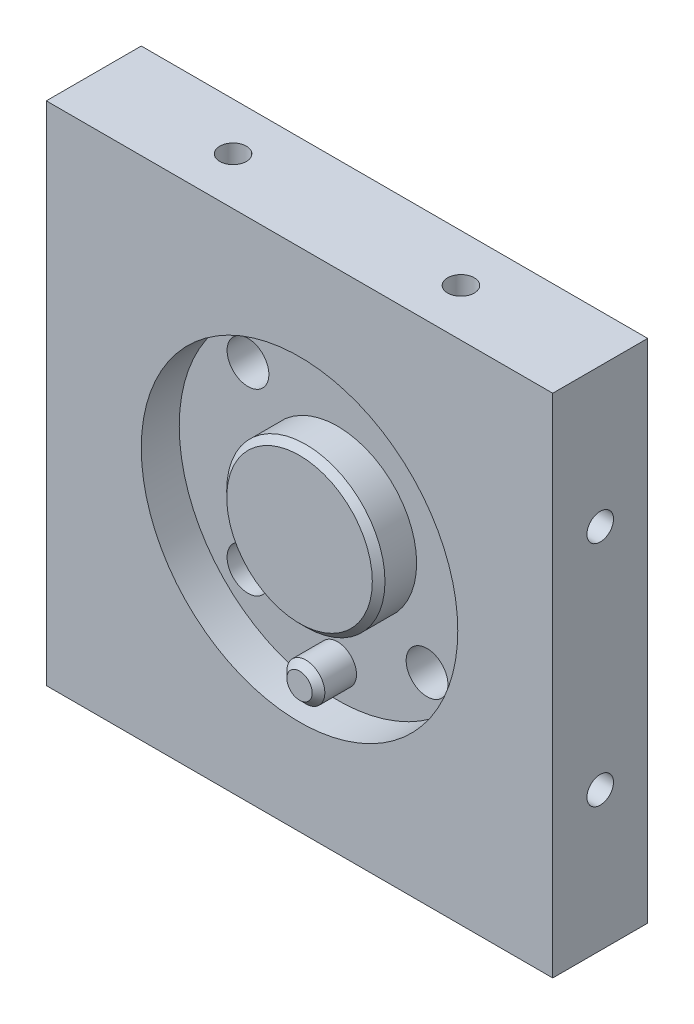
ISO-10303-21;
HEADER;
FILE_DESCRIPTION(('STEP AP214'),'2;1');
FILE_NAME('part.step','',(''),(''),'','','');
FILE_SCHEMA(('AUTOMOTIVE_DESIGN { 1 0 10303 214 1 1 1 1 }'));
ENDSEC;
DATA;
#1=APPLICATION_CONTEXT('core data for automotive mechanical design processes');
#2=APPLICATION_PROTOCOL_DEFINITION('international standard','automotive_design',2000,#1);
#3=PRODUCT_CONTEXT('',#1,'mechanical');
#4=PRODUCT('Part','Part','',(#3));
#5=PRODUCT_RELATED_PRODUCT_CATEGORY('part','',(#4));
#6=PRODUCT_DEFINITION_FORMATION('','',#4);
#7=PRODUCT_DEFINITION_CONTEXT('part definition',#1,'design');
#8=PRODUCT_DEFINITION('design','',#6,#7);
#9=PRODUCT_DEFINITION_SHAPE('','',#8);
#10=(LENGTH_UNIT() NAMED_UNIT(*) SI_UNIT(.MILLI.,.METRE.));
#11=(NAMED_UNIT(*) PLANE_ANGLE_UNIT() SI_UNIT($,.RADIAN.));
#12=(NAMED_UNIT(*) SI_UNIT($,.STERADIAN.) SOLID_ANGLE_UNIT());
#13=UNCERTAINTY_MEASURE_WITH_UNIT(LENGTH_MEASURE(1.E-05),#10,'distance_accuracy_value','');
#14=(GEOMETRIC_REPRESENTATION_CONTEXT(3) GLOBAL_UNCERTAINTY_ASSIGNED_CONTEXT((#13)) GLOBAL_UNIT_ASSIGNED_CONTEXT((#10,
#11,#12)) REPRESENTATION_CONTEXT('',''));
#15=CARTESIAN_POINT('',(0.,0.,0.));
#16=DIRECTION('',(0.,0.,1.));
#17=DIRECTION('',(1.,0.,0.));
#18=AXIS2_PLACEMENT_3D('',#15,#16,#17);
#19=CARTESIAN_POINT('',(-40.,-40.,0.));
#20=DIRECTION('',(0.,0.,1.));
#21=DIRECTION('',(1.,0.,0.));
#22=AXIS2_PLACEMENT_3D('',#19,#20,#21);
#23=PLANE('',#22);
#24=CARTESIAN_POINT('',(14.1421356237311,-14.1421356237308,0.));
#25=DIRECTION('',(0.,0.,-1.));
#26=DIRECTION('',(0.,1.,0.));
#27=AXIS2_PLACEMENT_3D('',#24,#25,#26);
#28=CIRCLE('',#27,5.5);
#29=CARTESIAN_POINT('',(14.1421356237311,-8.64213562373078,0.));
#30=VERTEX_POINT('',#29);
#31=EDGE_CURVE('E175',#30,#30,#28,.T.);
#32=ORIENTED_EDGE('',*,*,#31,.F.);
#33=EDGE_LOOP('',(#32));
#34=FACE_BOUND('',#33,.T.);
#35=DIRECTION('',(0.,-1.,0.));
#36=VECTOR('',#35,1.);
#37=CARTESIAN_POINT('',(-40.,40.,0.));
#38=LINE('',#37,#36);
#39=CARTESIAN_POINT('',(-40.,40.,0.));
#40=VERTEX_POINT('',#39);
#41=CARTESIAN_POINT('',(-40.,-40.,0.));
#42=VERTEX_POINT('',#41);
#43=EDGE_CURVE('E233',#40,#42,#38,.T.);
#44=ORIENTED_EDGE('',*,*,#43,.F.);
#45=DIRECTION('',(-1.,0.,0.));
#46=VECTOR('',#45,1.);
#47=CARTESIAN_POINT('',(-40.,40.,0.));
#48=LINE('',#47,#46);
#49=CARTESIAN_POINT('',(40.,40.,0.));
#50=VERTEX_POINT('',#49);
#51=EDGE_CURVE('E85',#50,#40,#48,.T.);
#52=ORIENTED_EDGE('',*,*,#51,.F.);
#53=DIRECTION('',(0.,1.,0.));
#54=VECTOR('',#53,1.);
#55=CARTESIAN_POINT('',(40.,40.,0.));
#56=LINE('',#55,#54);
#57=CARTESIAN_POINT('',(40.,-40.,0.));
#58=VERTEX_POINT('',#57);
#59=EDGE_CURVE('E79',#58,#50,#56,.T.);
#60=ORIENTED_EDGE('',*,*,#59,.F.);
#61=DIRECTION('',(1.,0.,0.));
#62=VECTOR('',#61,1.);
#63=CARTESIAN_POINT('',(-40.,-40.,0.));
#64=LINE('',#63,#62);
#65=EDGE_CURVE('E245',#42,#58,#64,.T.);
#66=ORIENTED_EDGE('',*,*,#65,.F.);
#67=EDGE_LOOP('',(#44,#52,#60,#66));
#68=FACE_BOUND('',#67,.T.);
#69=CARTESIAN_POINT('',(14.1421356237309,14.142135623731,0.));
#70=DIRECTION('',(0.,0.,-1.));
#71=DIRECTION('',(-1.,0.,0.));
#72=AXIS2_PLACEMENT_3D('',#69,#70,#71);
#73=CIRCLE('',#72,5.5);
#74=CARTESIAN_POINT('',(8.64213562373092,14.142135623731,0.));
#75=VERTEX_POINT('',#74);
#76=EDGE_CURVE('E211',#75,#75,#73,.T.);
#77=ORIENTED_EDGE('',*,*,#76,.F.);
#78=EDGE_LOOP('',(#77));
#79=FACE_BOUND('',#78,.T.);
#80=CARTESIAN_POINT('',(-14.142135623731,14.1421356237309,0.));
#81=DIRECTION('',(0.,0.,-1.));
#82=DIRECTION('',(0.,1.,0.));
#83=AXIS2_PLACEMENT_3D('',#80,#81,#82);
#84=CIRCLE('',#83,5.5);
#85=CARTESIAN_POINT('',(-14.142135623731,19.6421356237309,0.));
#86=VERTEX_POINT('',#85);
#87=EDGE_CURVE('E199',#86,#86,#84,.T.);
#88=ORIENTED_EDGE('',*,*,#87,.F.);
#89=EDGE_LOOP('',(#88));
#90=FACE_BOUND('',#89,.T.);
#91=CARTESIAN_POINT('',(-14.1421356237308,-14.1421356237311,0.));
#92=DIRECTION('',(0.,0.,-1.));
#93=DIRECTION('',(0.,1.,0.));
#94=AXIS2_PLACEMENT_3D('',#91,#92,#93);
#95=CIRCLE('',#94,5.5);
#96=CARTESIAN_POINT('',(-14.1421356237308,-8.64213562373108,0.));
#97=VERTEX_POINT('',#96);
#98=EDGE_CURVE('E187',#97,#97,#95,.T.);
#99=ORIENTED_EDGE('',*,*,#98,.F.);
#100=EDGE_LOOP('',(#99));
#101=FACE_BOUND('',#100,.T.);
#102=ADVANCED_FACE('F44',(#34,#68,#79,#90,#101),#23,.F.);
#103=CARTESIAN_POINT('',(-40.,40.,15.));
#104=DIRECTION('',(1.,0.,0.));
#105=DIRECTION('',(0.,1.,0.));
#106=AXIS2_PLACEMENT_3D('',#103,#104,#105);
#107=PLANE('',#106);
#108=CARTESIAN_POINT('',(-40.,18.,7.5));
#109=DIRECTION('',(-1.,0.,0.));
#110=DIRECTION('',(0.,0.,1.));
#111=AXIS2_PLACEMENT_3D('',#108,#109,#110);
#112=CIRCLE('',#111,2.1);
#113=CARTESIAN_POINT('',(-40.,18.,9.6));
#114=VERTEX_POINT('',#113);
#115=EDGE_CURVE('E129',#114,#114,#112,.T.);
#116=ORIENTED_EDGE('',*,*,#115,.F.);
#117=EDGE_LOOP('',(#116));
#118=FACE_BOUND('',#117,.T.);
#119=CARTESIAN_POINT('',(-40.,-18.,7.5));
#120=DIRECTION('',(-1.,0.,0.));
#121=DIRECTION('',(0.,0.,1.));
#122=AXIS2_PLACEMENT_3D('',#119,#120,#121);
#123=CIRCLE('',#122,2.1);
#124=CARTESIAN_POINT('',(-40.,-18.,9.6));
#125=VERTEX_POINT('',#124);
#126=EDGE_CURVE('E151',#125,#125,#123,.T.);
#127=ORIENTED_EDGE('',*,*,#126,.F.);
#128=EDGE_LOOP('',(#127));
#129=FACE_BOUND('',#128,.T.);
#130=ORIENTED_EDGE('',*,*,#43,.T.);
#131=DIRECTION('',(0.,0.,-1.));
#132=VECTOR('',#131,1.);
#133=CARTESIAN_POINT('',(-40.,-40.,15.));
#134=LINE('',#133,#132);
#135=CARTESIAN_POINT('',(-40.,-40.,15.));
#136=VERTEX_POINT('',#135);
#137=EDGE_CURVE('E254',#136,#42,#134,.T.);
#138=ORIENTED_EDGE('',*,*,#137,.F.);
#139=DIRECTION('',(0.,-1.,0.));
#140=VECTOR('',#139,1.);
#141=CARTESIAN_POINT('',(-40.,40.,15.));
#142=LINE('',#141,#140);
#143=CARTESIAN_POINT('',(-40.,40.,15.));
#144=VERTEX_POINT('',#143);
#145=EDGE_CURVE('E236',#144,#136,#142,.T.);
#146=ORIENTED_EDGE('',*,*,#145,.F.);
#147=DIRECTION('',(0.,0.,-1.));
#148=VECTOR('',#147,1.);
#149=CARTESIAN_POINT('',(-40.,40.,15.));
#150=LINE('',#149,#148);
#151=EDGE_CURVE('E242',#144,#40,#150,.T.);
#152=ORIENTED_EDGE('',*,*,#151,.T.);
#153=EDGE_LOOP('',(#130,#138,#146,#152));
#154=FACE_BOUND('',#153,.T.);
#155=ADVANCED_FACE('F281',(#118,#129,#154),#107,.F.);
#156=CARTESIAN_POINT('',(-40.,-40.,15.));
#157=DIRECTION('',(0.,1.,0.));
#158=DIRECTION('',(0.,0.,1.));
#159=AXIS2_PLACEMENT_3D('',#156,#157,#158);
#160=PLANE('',#159);
#161=CARTESIAN_POINT('',(18.,-40.,7.5));
#162=DIRECTION('',(0.,-1.,0.));
#163=DIRECTION('',(0.,0.,-1.));
#164=AXIS2_PLACEMENT_3D('',#161,#162,#163);
#165=CIRCLE('',#164,2.09999999999999);
#166=CARTESIAN_POINT('',(18.,-40.,5.40000000000001));
#167=VERTEX_POINT('',#166);
#168=EDGE_CURVE('E157',#167,#167,#165,.T.);
#169=ORIENTED_EDGE('',*,*,#168,.F.);
#170=EDGE_LOOP('',(#169));
#171=FACE_BOUND('',#170,.T.);
#172=CARTESIAN_POINT('',(-18.,-40.,7.5));
#173=DIRECTION('',(0.,-1.,0.));
#174=DIRECTION('',(0.,0.,-1.));
#175=AXIS2_PLACEMENT_3D('',#172,#173,#174);
#176=CIRCLE('',#175,2.09999999999999);
#177=CARTESIAN_POINT('',(-18.,-40.,5.40000000000001));
#178=VERTEX_POINT('',#177);
#179=EDGE_CURVE('E163',#178,#178,#176,.T.);
#180=ORIENTED_EDGE('',*,*,#179,.F.);
#181=EDGE_LOOP('',(#180));
#182=FACE_BOUND('',#181,.T.);
#183=ORIENTED_EDGE('',*,*,#65,.T.);
#184=DIRECTION('',(0.,0.,-1.));
#185=VECTOR('',#184,1.);
#186=CARTESIAN_POINT('',(40.,-40.,15.));
#187=LINE('',#186,#185);
#188=CARTESIAN_POINT('',(40.,-40.,15.));
#189=VERTEX_POINT('',#188);
#190=EDGE_CURVE('E252',#189,#58,#187,.T.);
#191=ORIENTED_EDGE('',*,*,#190,.F.);
#192=DIRECTION('',(1.,0.,0.));
#193=VECTOR('',#192,1.);
#194=CARTESIAN_POINT('',(-40.,-40.,15.));
#195=LINE('',#194,#193);
#196=EDGE_CURVE('E93',#136,#189,#195,.T.);
#197=ORIENTED_EDGE('',*,*,#196,.F.);
#198=ORIENTED_EDGE('',*,*,#137,.T.);
#199=EDGE_LOOP('',(#183,#191,#197,#198));
#200=FACE_BOUND('',#199,.T.);
#201=ADVANCED_FACE('F287',(#171,#182,#200),#160,.F.);
#202=CARTESIAN_POINT('',(40.,40.,15.));
#203=DIRECTION('',(-1.,0.,0.));
#204=DIRECTION('',(0.,-1.,0.));
#205=AXIS2_PLACEMENT_3D('',#202,#203,#204);
#206=PLANE('',#205);
#207=CARTESIAN_POINT('',(40.,18.,7.5));
#208=DIRECTION('',(1.,0.,0.));
#209=DIRECTION('',(0.,0.,-1.));
#210=AXIS2_PLACEMENT_3D('',#207,#208,#209);
#211=CIRCLE('',#210,2.1);
#212=CARTESIAN_POINT('',(40.,18.,5.4));
#213=VERTEX_POINT('',#212);
#214=EDGE_CURVE('E145',#213,#213,#211,.T.);
#215=ORIENTED_EDGE('',*,*,#214,.F.);
#216=EDGE_LOOP('',(#215));
#217=FACE_BOUND('',#216,.T.);
#218=CARTESIAN_POINT('',(40.,-18.,7.5));
#219=DIRECTION('',(1.,0.,0.));
#220=DIRECTION('',(0.,0.,-1.));
#221=AXIS2_PLACEMENT_3D('',#218,#219,#220);
#222=CIRCLE('',#221,2.1);
#223=CARTESIAN_POINT('',(40.,-18.,5.4));
#224=VERTEX_POINT('',#223);
#225=EDGE_CURVE('E169',#224,#224,#222,.T.);
#226=ORIENTED_EDGE('',*,*,#225,.F.);
#227=EDGE_LOOP('',(#226));
#228=FACE_BOUND('',#227,.T.);
#229=ORIENTED_EDGE('',*,*,#59,.T.);
#230=DIRECTION('',(0.,0.,-1.));
#231=VECTOR('',#230,1.);
#232=CARTESIAN_POINT('',(40.,40.,15.));
#233=LINE('',#232,#231);
#234=CARTESIAN_POINT('',(40.,40.,15.));
#235=VERTEX_POINT('',#234);
#236=EDGE_CURVE('E250',#235,#50,#233,.T.);
#237=ORIENTED_EDGE('',*,*,#236,.F.);
#238=DIRECTION('',(0.,1.,0.));
#239=VECTOR('',#238,1.);
#240=CARTESIAN_POINT('',(40.,40.,15.));
#241=LINE('',#240,#239);
#242=EDGE_CURVE('E239',#189,#235,#241,.T.);
#243=ORIENTED_EDGE('',*,*,#242,.F.);
#244=ORIENTED_EDGE('',*,*,#190,.T.);
#245=EDGE_LOOP('',(#229,#237,#243,#244));
#246=FACE_BOUND('',#245,.T.);
#247=ADVANCED_FACE('F299',(#217,#228,#246),#206,.F.);
#248=CARTESIAN_POINT('',(-40.,40.,15.));
#249=DIRECTION('',(0.,-1.,0.));
#250=DIRECTION('',(0.,0.,-1.));
#251=AXIS2_PLACEMENT_3D('',#248,#249,#250);
#252=PLANE('',#251);
#253=CARTESIAN_POINT('',(18.,40.,7.5));
#254=DIRECTION('',(0.,1.,0.));
#255=DIRECTION('',(0.,0.,1.));
#256=AXIS2_PLACEMENT_3D('',#253,#254,#255);
#257=CIRCLE('',#256,2.09999999999999);
#258=CARTESIAN_POINT('',(18.,40.,9.59999999999999));
#259=VERTEX_POINT('',#258);
#260=EDGE_CURVE('E128',#259,#259,#257,.T.);
#261=ORIENTED_EDGE('',*,*,#260,.F.);
#262=EDGE_LOOP('',(#261));
#263=FACE_BOUND('',#262,.T.);
#264=CARTESIAN_POINT('',(-18.,40.,7.5));
#265=DIRECTION('',(0.,1.,0.));
#266=DIRECTION('',(0.,0.,1.));
#267=AXIS2_PLACEMENT_3D('',#264,#265,#266);
#268=CIRCLE('',#267,2.09999999999999);
#269=CARTESIAN_POINT('',(-18.,40.,9.59999999999999));
#270=VERTEX_POINT('',#269);
#271=EDGE_CURVE('E139',#270,#270,#268,.T.);
#272=ORIENTED_EDGE('',*,*,#271,.F.);
#273=EDGE_LOOP('',(#272));
#274=FACE_BOUND('',#273,.T.);
#275=ORIENTED_EDGE('',*,*,#51,.T.);
#276=ORIENTED_EDGE('',*,*,#151,.F.);
#277=DIRECTION('',(-1.,0.,0.));
#278=VECTOR('',#277,1.);
#279=CARTESIAN_POINT('',(-40.,40.,15.));
#280=LINE('',#279,#278);
#281=EDGE_CURVE('E61',#235,#144,#280,.T.);
#282=ORIENTED_EDGE('',*,*,#281,.F.);
#283=ORIENTED_EDGE('',*,*,#236,.T.);
#284=EDGE_LOOP('',(#275,#276,#282,#283));
#285=FACE_BOUND('',#284,.T.);
#286=ADVANCED_FACE('F296',(#263,#274,#285),#252,.F.);
#287=CARTESIAN_POINT('',(-40.,-40.,15.));
#288=DIRECTION('',(0.,0.,1.));
#289=DIRECTION('',(1.,0.,0.));
#290=AXIS2_PLACEMENT_3D('',#287,#288,#289);
#291=PLANE('',#290);
#292=CARTESIAN_POINT('',(0.,0.,15.));
#293=DIRECTION('',(0.,0.,1.));
#294=DIRECTION('',(1.,0.,0.));
#295=AXIS2_PLACEMENT_3D('',#292,#293,#294);
#296=CIRCLE('',#295,25.);
#297=CARTESIAN_POINT('',(25.,0.,15.));
#298=VERTEX_POINT('',#297);
#299=EDGE_CURVE('E229',#298,#298,#296,.T.);
#300=ORIENTED_EDGE('',*,*,#299,.F.);
#301=EDGE_LOOP('',(#300));
#302=FACE_BOUND('',#301,.T.);
#303=ORIENTED_EDGE('',*,*,#145,.T.);
#304=ORIENTED_EDGE('',*,*,#196,.T.);
#305=ORIENTED_EDGE('',*,*,#242,.T.);
#306=ORIENTED_EDGE('',*,*,#281,.T.);
#307=EDGE_LOOP('',(#303,#304,#305,#306));
#308=FACE_BOUND('',#307,.T.);
#309=ADVANCED_FACE('F294',(#302,#308),#291,.T.);
#310=CARTESIAN_POINT('',(0.,0.,9.));
#311=DIRECTION('',(0.,0.,1.));
#312=DIRECTION('',(1.,0.,0.));
#313=AXIS2_PLACEMENT_3D('',#310,#311,#312);
#314=CYLINDRICAL_SURFACE('',#313,25.);
#315=CARTESIAN_POINT('',(0.,0.,9.));
#316=DIRECTION('',(0.,0.,1.));
#317=DIRECTION('',(1.,0.,0.));
#318=AXIS2_PLACEMENT_3D('',#315,#316,#317);
#319=CIRCLE('',#318,25.);
#320=CARTESIAN_POINT('',(25.,0.,9.));
#321=VERTEX_POINT('',#320);
#322=EDGE_CURVE('E230',#321,#321,#319,.T.);
#323=ORIENTED_EDGE('',*,*,#322,.F.);
#324=EDGE_LOOP('',(#323));
#325=FACE_BOUND('',#324,.T.);
#326=ORIENTED_EDGE('',*,*,#299,.T.);
#327=EDGE_LOOP('',(#326));
#328=FACE_BOUND('',#327,.T.);
#329=ADVANCED_FACE('F318',(#325,#328),#314,.F.);
#330=CARTESIAN_POINT('',(0.,0.,9.));
#331=DIRECTION('',(0.,0.,1.));
#332=DIRECTION('',(1.,0.,0.));
#333=AXIS2_PLACEMENT_3D('',#330,#331,#332);
#334=PLANE('',#333);
#335=CARTESIAN_POINT('',(14.1421356237311,-14.1421356237308,9.));
#336=DIRECTION('',(0.,0.,1.));
#337=DIRECTION('',(1.,0.,0.));
#338=AXIS2_PLACEMENT_3D('',#335,#336,#337);
#339=CIRCLE('',#338,3.3);
#340=CARTESIAN_POINT('',(17.4421356237311,-14.1421356237308,9.));
#341=VERTEX_POINT('',#340);
#342=EDGE_CURVE('E184',#341,#341,#339,.T.);
#343=ORIENTED_EDGE('',*,*,#342,.F.);
#344=EDGE_LOOP('',(#343));
#345=FACE_BOUND('',#344,.T.);
#346=CARTESIAN_POINT('',(-14.1421356237308,-14.1421356237311,9.));
#347=DIRECTION('',(0.,0.,1.));
#348=DIRECTION('',(1.,0.,0.));
#349=AXIS2_PLACEMENT_3D('',#346,#347,#348);
#350=CIRCLE('',#349,3.3);
#351=CARTESIAN_POINT('',(-10.8421356237308,-14.1421356237311,9.));
#352=VERTEX_POINT('',#351);
#353=EDGE_CURVE('E196',#352,#352,#350,.T.);
#354=ORIENTED_EDGE('',*,*,#353,.F.);
#355=EDGE_LOOP('',(#354));
#356=FACE_BOUND('',#355,.T.);
#357=CARTESIAN_POINT('',(-14.142135623731,14.1421356237309,9.));
#358=DIRECTION('',(0.,0.,1.));
#359=DIRECTION('',(1.,0.,0.));
#360=AXIS2_PLACEMENT_3D('',#357,#358,#359);
#361=CIRCLE('',#360,3.3);
#362=CARTESIAN_POINT('',(-10.842135623731,14.1421356237309,9.));
#363=VERTEX_POINT('',#362);
#364=EDGE_CURVE('E208',#363,#363,#361,.T.);
#365=ORIENTED_EDGE('',*,*,#364,.F.);
#366=EDGE_LOOP('',(#365));
#367=FACE_BOUND('',#366,.T.);
#368=CARTESIAN_POINT('',(14.1421356237309,14.142135623731,9.));
#369=DIRECTION('',(0.,0.,1.));
#370=DIRECTION('',(1.,0.,0.));
#371=AXIS2_PLACEMENT_3D('',#368,#369,#370);
#372=CIRCLE('',#371,3.3);
#373=CARTESIAN_POINT('',(17.4421356237309,14.142135623731,9.));
#374=VERTEX_POINT('',#373);
#375=EDGE_CURVE('E220',#374,#374,#372,.T.);
#376=ORIENTED_EDGE('',*,*,#375,.F.);
#377=EDGE_LOOP('',(#376));
#378=FACE_BOUND('',#377,.T.);
#379=CARTESIAN_POINT('',(0.,-20.,9.));
#380=DIRECTION('',(0.,0.,1.));
#381=DIRECTION('',(1.,0.,0.));
#382=AXIS2_PLACEMENT_3D('',#379,#380,#381);
#383=CIRCLE('',#382,3.);
#384=CARTESIAN_POINT('',(3.,-20.,9.));
#385=VERTEX_POINT('',#384);
#386=EDGE_CURVE('E223',#385,#385,#383,.T.);
#387=ORIENTED_EDGE('',*,*,#386,.F.);
#388=EDGE_LOOP('',(#387));
#389=FACE_BOUND('',#388,.T.);
#390=CARTESIAN_POINT('',(0.,0.,9.));
#391=DIRECTION('',(0.,0.,1.));
#392=DIRECTION('',(1.,0.,0.));
#393=AXIS2_PLACEMENT_3D('',#390,#391,#392);
#394=CIRCLE('',#393,12.5);
#395=CARTESIAN_POINT('',(12.5,0.,9.));
#396=VERTEX_POINT('',#395);
#397=EDGE_CURVE('E226',#396,#396,#394,.T.);
#398=ORIENTED_EDGE('',*,*,#397,.F.);
#399=EDGE_LOOP('',(#398));
#400=FACE_BOUND('',#399,.T.);
#401=ORIENTED_EDGE('',*,*,#322,.T.);
#402=EDGE_LOOP('',(#401));
#403=FACE_BOUND('',#402,.T.);
#404=ADVANCED_FACE('F324',(#345,#356,#367,#378,#389,#400,#403),#334,.T.);
#405=CARTESIAN_POINT('',(0.,0.,9.));
#406=DIRECTION('',(0.,0.,1.));
#407=DIRECTION('',(1.,0.,0.));
#408=AXIS2_PLACEMENT_3D('',#405,#406,#407);
#409=CYLINDRICAL_SURFACE('',#408,12.5);
#410=CARTESIAN_POINT('',(0.,0.,14.));
#411=DIRECTION('',(0.,0.,1.));
#412=DIRECTION('',(1.,0.,0.));
#413=AXIS2_PLACEMENT_3D('',#410,#411,#412);
#414=CIRCLE('',#413,12.5);
#415=CARTESIAN_POINT('',(12.5,0.,14.));
#416=VERTEX_POINT('',#415);
#417=EDGE_CURVE('E13',#416,#416,#414,.F.);
#418=ORIENTED_EDGE('',*,*,#417,.T.);
#419=EDGE_LOOP('',(#418));
#420=FACE_BOUND('',#419,.T.);
#421=ORIENTED_EDGE('',*,*,#397,.T.);
#422=EDGE_LOOP('',(#421));
#423=FACE_BOUND('',#422,.T.);
#424=ADVANCED_FACE('F351',(#420,#423),#409,.T.);
#425=CARTESIAN_POINT('',(0.,-20.,9.));
#426=DIRECTION('',(0.,0.,1.));
#427=DIRECTION('',(1.,0.,0.));
#428=AXIS2_PLACEMENT_3D('',#425,#426,#427);
#429=CYLINDRICAL_SURFACE('',#428,3.);
#430=CARTESIAN_POINT('',(0.,-20.,14.));
#431=DIRECTION('',(0.,0.,1.));
#432=DIRECTION('',(1.,0.,0.));
#433=AXIS2_PLACEMENT_3D('',#430,#431,#432);
#434=CIRCLE('',#433,3.);
#435=CARTESIAN_POINT('',(3.,-20.,14.));
#436=VERTEX_POINT('',#435);
#437=EDGE_CURVE('E259',#436,#436,#434,.F.);
#438=ORIENTED_EDGE('',*,*,#437,.T.);
#439=EDGE_LOOP('',(#438));
#440=FACE_BOUND('',#439,.T.);
#441=ORIENTED_EDGE('',*,*,#386,.T.);
#442=EDGE_LOOP('',(#441));
#443=FACE_BOUND('',#442,.T.);
#444=ADVANCED_FACE('F328',(#440,#443),#429,.T.);
#445=CARTESIAN_POINT('',(0.,0.,15.));
#446=DIRECTION('',(0.,0.,1.));
#447=DIRECTION('',(1.,0.,0.));
#448=AXIS2_PLACEMENT_3D('',#445,#446,#447);
#449=CIRCLE('',#448,11.5);
#450=CARTESIAN_POINT('',(11.5,0.,15.));
#451=VERTEX_POINT('',#450);
#452=EDGE_CURVE('E53',#451,#451,#449,.T.);
#453=ORIENTED_EDGE('',*,*,#452,.T.);
#454=EDGE_LOOP('',(#453));
#455=FACE_BOUND('',#454,.T.);
#456=ADVANCED_FACE('F264',(#455),#291,.T.);
#457=CARTESIAN_POINT('',(0.,-20.,15.));
#458=DIRECTION('',(0.,0.,1.));
#459=DIRECTION('',(1.,0.,0.));
#460=AXIS2_PLACEMENT_3D('',#457,#458,#459);
#461=CIRCLE('',#460,2.);
#462=CARTESIAN_POINT('',(2.,-20.,15.));
#463=VERTEX_POINT('',#462);
#464=EDGE_CURVE('E256',#463,#463,#461,.T.);
#465=ORIENTED_EDGE('',*,*,#464,.T.);
#466=EDGE_LOOP('',(#465));
#467=FACE_BOUND('',#466,.T.);
#468=ADVANCED_FACE('F320',(#467),#291,.T.);
#469=CARTESIAN_POINT('',(14.1421356237309,14.142135623731,0.));
#470=DIRECTION('',(0.,0.,-1.));
#471=DIRECTION('',(-1.,0.,0.));
#472=AXIS2_PLACEMENT_3D('',#469,#470,#471);
#473=CYLINDRICAL_SURFACE('',#472,3.3);
#474=CARTESIAN_POINT('',(14.1421356237309,14.142135623731,2.));
#475=DIRECTION('',(0.,0.,-1.));
#476=DIRECTION('',(-1.,0.,0.));
#477=AXIS2_PLACEMENT_3D('',#474,#475,#476);
#478=CIRCLE('',#477,3.3);
#479=CARTESIAN_POINT('',(10.8421356237309,14.142135623731,2.));
#480=VERTEX_POINT('',#479);
#481=EDGE_CURVE('E217',#480,#480,#478,.T.);
#482=ORIENTED_EDGE('',*,*,#481,.T.);
#483=EDGE_LOOP('',(#482));
#484=FACE_BOUND('',#483,.T.);
#485=ORIENTED_EDGE('',*,*,#375,.T.);
#486=EDGE_LOOP('',(#485));
#487=FACE_BOUND('',#486,.T.);
#488=ADVANCED_FACE('F330',(#484,#487),#473,.F.);
#489=CARTESIAN_POINT('',(17.4421356237309,14.142135623731,2.));
#490=DIRECTION('',(0.,0.,1.));
#491=DIRECTION('',(1.,0.,0.));
#492=AXIS2_PLACEMENT_3D('',#489,#490,#491);
#493=PLANE('',#492);
#494=ORIENTED_EDGE('',*,*,#481,.F.);
#495=EDGE_LOOP('',(#494));
#496=FACE_BOUND('',#495,.T.);
#497=CARTESIAN_POINT('',(14.1421356237309,14.142135623731,2.));
#498=DIRECTION('',(0.,0.,-1.));
#499=DIRECTION('',(-1.,0.,0.));
#500=AXIS2_PLACEMENT_3D('',#497,#498,#499);
#501=CIRCLE('',#500,5.5);
#502=CARTESIAN_POINT('',(8.64213562373092,14.142135623731,2.));
#503=VERTEX_POINT('',#502);
#504=EDGE_CURVE('E214',#503,#503,#501,.T.);
#505=ORIENTED_EDGE('',*,*,#504,.T.);
#506=EDGE_LOOP('',(#505));
#507=FACE_BOUND('',#506,.T.);
#508=ADVANCED_FACE('F335',(#496,#507),#493,.F.);
#509=CARTESIAN_POINT('',(14.1421356237309,14.142135623731,0.));
#510=DIRECTION('',(0.,0.,-1.));
#511=DIRECTION('',(-1.,0.,0.));
#512=AXIS2_PLACEMENT_3D('',#509,#510,#511);
#513=CYLINDRICAL_SURFACE('',#512,5.5);
#514=ORIENTED_EDGE('',*,*,#504,.F.);
#515=EDGE_LOOP('',(#514));
#516=FACE_BOUND('',#515,.T.);
#517=ORIENTED_EDGE('',*,*,#76,.T.);
#518=EDGE_LOOP('',(#517));
#519=FACE_BOUND('',#518,.T.);
#520=ADVANCED_FACE('F343',(#516,#519),#513,.F.);
#521=CARTESIAN_POINT('',(-14.142135623731,14.1421356237309,0.));
#522=DIRECTION('',(0.,0.,-1.));
#523=DIRECTION('',(0.,1.,0.));
#524=AXIS2_PLACEMENT_3D('',#521,#522,#523);
#525=CYLINDRICAL_SURFACE('',#524,3.3);
#526=CARTESIAN_POINT('',(-14.142135623731,14.1421356237309,2.));
#527=DIRECTION('',(0.,0.,-1.));
#528=DIRECTION('',(0.,1.,0.));
#529=AXIS2_PLACEMENT_3D('',#526,#527,#528);
#530=CIRCLE('',#529,3.3);
#531=CARTESIAN_POINT('',(-14.142135623731,17.4421356237309,2.));
#532=VERTEX_POINT('',#531);
#533=EDGE_CURVE('E205',#532,#532,#530,.T.);
#534=ORIENTED_EDGE('',*,*,#533,.T.);
#535=EDGE_LOOP('',(#534));
#536=FACE_BOUND('',#535,.T.);
#537=ORIENTED_EDGE('',*,*,#364,.T.);
#538=EDGE_LOOP('',(#537));
#539=FACE_BOUND('',#538,.T.);
#540=ADVANCED_FACE('F377',(#536,#539),#525,.F.);
#541=CARTESIAN_POINT('',(-10.842135623731,14.1421356237309,2.));
#542=DIRECTION('',(0.,0.,1.));
#543=DIRECTION('',(0.,-1.,0.));
#544=AXIS2_PLACEMENT_3D('',#541,#542,#543);
#545=PLANE('',#544);
#546=ORIENTED_EDGE('',*,*,#533,.F.);
#547=EDGE_LOOP('',(#546));
#548=FACE_BOUND('',#547,.T.);
#549=CARTESIAN_POINT('',(-14.142135623731,14.1421356237309,2.));
#550=DIRECTION('',(0.,0.,-1.));
#551=DIRECTION('',(0.,1.,0.));
#552=AXIS2_PLACEMENT_3D('',#549,#550,#551);
#553=CIRCLE('',#552,5.5);
#554=CARTESIAN_POINT('',(-14.142135623731,19.6421356237309,2.));
#555=VERTEX_POINT('',#554);
#556=EDGE_CURVE('E202',#555,#555,#553,.T.);
#557=ORIENTED_EDGE('',*,*,#556,.T.);
#558=EDGE_LOOP('',(#557));
#559=FACE_BOUND('',#558,.T.);
#560=ADVANCED_FACE('F379',(#548,#559),#545,.F.);
#561=CARTESIAN_POINT('',(-14.142135623731,14.1421356237309,0.));
#562=DIRECTION('',(0.,0.,-1.));
#563=DIRECTION('',(0.,1.,0.));
#564=AXIS2_PLACEMENT_3D('',#561,#562,#563);
#565=CYLINDRICAL_SURFACE('',#564,5.5);
#566=ORIENTED_EDGE('',*,*,#556,.F.);
#567=EDGE_LOOP('',(#566));
#568=FACE_BOUND('',#567,.T.);
#569=ORIENTED_EDGE('',*,*,#87,.T.);
#570=EDGE_LOOP('',(#569));
#571=FACE_BOUND('',#570,.T.);
#572=ADVANCED_FACE('F386',(#568,#571),#565,.F.);
#573=CARTESIAN_POINT('',(-14.1421356237308,-14.1421356237311,0.));
#574=DIRECTION('',(0.,0.,-1.));
#575=DIRECTION('',(0.,1.,0.));
#576=AXIS2_PLACEMENT_3D('',#573,#574,#575);
#577=CYLINDRICAL_SURFACE('',#576,3.3);
#578=CARTESIAN_POINT('',(-14.1421356237308,-14.1421356237311,2.));
#579=DIRECTION('',(0.,0.,-1.));
#580=DIRECTION('',(0.,1.,0.));
#581=AXIS2_PLACEMENT_3D('',#578,#579,#580);
#582=CIRCLE('',#581,3.3);
#583=CARTESIAN_POINT('',(-14.1421356237308,-10.8421356237311,2.));
#584=VERTEX_POINT('',#583);
#585=EDGE_CURVE('E193',#584,#584,#582,.T.);
#586=ORIENTED_EDGE('',*,*,#585,.T.);
#587=EDGE_LOOP('',(#586));
#588=FACE_BOUND('',#587,.T.);
#589=ORIENTED_EDGE('',*,*,#353,.T.);
#590=EDGE_LOOP('',(#589));
#591=FACE_BOUND('',#590,.T.);
#592=ADVANCED_FACE('F393',(#588,#591),#577,.F.);
#593=CARTESIAN_POINT('',(-10.8421356237308,-14.1421356237311,2.));
#594=DIRECTION('',(0.,0.,1.));
#595=DIRECTION('',(0.,-1.,0.));
#596=AXIS2_PLACEMENT_3D('',#593,#594,#595);
#597=PLANE('',#596);
#598=ORIENTED_EDGE('',*,*,#585,.F.);
#599=EDGE_LOOP('',(#598));
#600=FACE_BOUND('',#599,.T.);
#601=CARTESIAN_POINT('',(-14.1421356237308,-14.1421356237311,2.));
#602=DIRECTION('',(0.,0.,-1.));
#603=DIRECTION('',(0.,1.,0.));
#604=AXIS2_PLACEMENT_3D('',#601,#602,#603);
#605=CIRCLE('',#604,5.5);
#606=CARTESIAN_POINT('',(-14.1421356237308,-8.64213562373108,2.));
#607=VERTEX_POINT('',#606);
#608=EDGE_CURVE('E190',#607,#607,#605,.T.);
#609=ORIENTED_EDGE('',*,*,#608,.T.);
#610=EDGE_LOOP('',(#609));
#611=FACE_BOUND('',#610,.T.);
#612=ADVANCED_FACE('F397',(#600,#611),#597,.F.);
#613=CARTESIAN_POINT('',(-14.1421356237308,-14.1421356237311,0.));
#614=DIRECTION('',(0.,0.,-1.));
#615=DIRECTION('',(0.,1.,0.));
#616=AXIS2_PLACEMENT_3D('',#613,#614,#615);
#617=CYLINDRICAL_SURFACE('',#616,5.5);
#618=ORIENTED_EDGE('',*,*,#608,.F.);
#619=EDGE_LOOP('',(#618));
#620=FACE_BOUND('',#619,.T.);
#621=ORIENTED_EDGE('',*,*,#98,.T.);
#622=EDGE_LOOP('',(#621));
#623=FACE_BOUND('',#622,.T.);
#624=ADVANCED_FACE('F401',(#620,#623),#617,.F.);
#625=CARTESIAN_POINT('',(14.1421356237311,-14.1421356237308,0.));
#626=DIRECTION('',(0.,0.,-1.));
#627=DIRECTION('',(0.,1.,0.));
#628=AXIS2_PLACEMENT_3D('',#625,#626,#627);
#629=CYLINDRICAL_SURFACE('',#628,3.3);
#630=CARTESIAN_POINT('',(14.1421356237311,-14.1421356237308,2.));
#631=DIRECTION('',(0.,0.,-1.));
#632=DIRECTION('',(0.,1.,0.));
#633=AXIS2_PLACEMENT_3D('',#630,#631,#632);
#634=CIRCLE('',#633,3.3);
#635=CARTESIAN_POINT('',(14.1421356237311,-10.8421356237308,2.));
#636=VERTEX_POINT('',#635);
#637=EDGE_CURVE('E181',#636,#636,#634,.T.);
#638=ORIENTED_EDGE('',*,*,#637,.T.);
#639=EDGE_LOOP('',(#638));
#640=FACE_BOUND('',#639,.T.);
#641=ORIENTED_EDGE('',*,*,#342,.T.);
#642=EDGE_LOOP('',(#641));
#643=FACE_BOUND('',#642,.T.);
#644=ADVANCED_FACE('F405',(#640,#643),#629,.F.);
#645=CARTESIAN_POINT('',(17.4421356237311,-14.1421356237308,2.));
#646=DIRECTION('',(0.,0.,1.));
#647=DIRECTION('',(0.,-1.,0.));
#648=AXIS2_PLACEMENT_3D('',#645,#646,#647);
#649=PLANE('',#648);
#650=ORIENTED_EDGE('',*,*,#637,.F.);
#651=EDGE_LOOP('',(#650));
#652=FACE_BOUND('',#651,.T.);
#653=CARTESIAN_POINT('',(14.1421356237311,-14.1421356237308,2.));
#654=DIRECTION('',(0.,0.,-1.));
#655=DIRECTION('',(0.,1.,0.));
#656=AXIS2_PLACEMENT_3D('',#653,#654,#655);
#657=CIRCLE('',#656,5.5);
#658=CARTESIAN_POINT('',(14.1421356237311,-8.64213562373078,2.));
#659=VERTEX_POINT('',#658);
#660=EDGE_CURVE('E178',#659,#659,#657,.T.);
#661=ORIENTED_EDGE('',*,*,#660,.T.);
#662=EDGE_LOOP('',(#661));
#663=FACE_BOUND('',#662,.T.);
#664=ADVANCED_FACE('F409',(#652,#663),#649,.F.);
#665=CARTESIAN_POINT('',(14.1421356237311,-14.1421356237308,0.));
#666=DIRECTION('',(0.,0.,-1.));
#667=DIRECTION('',(0.,1.,0.));
#668=AXIS2_PLACEMENT_3D('',#665,#666,#667);
#669=CYLINDRICAL_SURFACE('',#668,5.5);
#670=ORIENTED_EDGE('',*,*,#660,.F.);
#671=EDGE_LOOP('',(#670));
#672=FACE_BOUND('',#671,.T.);
#673=ORIENTED_EDGE('',*,*,#31,.T.);
#674=EDGE_LOOP('',(#673));
#675=FACE_BOUND('',#674,.T.);
#676=ADVANCED_FACE('F277',(#672,#675),#669,.F.);
#677=CARTESIAN_POINT('',(0.,-20.,15.));
#678=DIRECTION('',(0.,0.,-1.));
#679=DIRECTION('',(-1.,0.,0.));
#680=AXIS2_PLACEMENT_3D('',#677,#678,#679);
#681=CONICAL_SURFACE('',#680,2.,0.785398163397451);
#682=ORIENTED_EDGE('',*,*,#437,.F.);
#683=EDGE_LOOP('',(#682));
#684=FACE_BOUND('',#683,.T.);
#685=ORIENTED_EDGE('',*,*,#464,.F.);
#686=EDGE_LOOP('',(#685));
#687=FACE_BOUND('',#686,.T.);
#688=ADVANCED_FACE('F268',(#684,#687),#681,.T.);
#689=CARTESIAN_POINT('',(0.,0.,15.));
#690=DIRECTION('',(0.,0.,-1.));
#691=DIRECTION('',(-1.,0.,0.));
#692=AXIS2_PLACEMENT_3D('',#689,#690,#691);
#693=CONICAL_SURFACE('',#692,11.5,0.785398163397455);
#694=ORIENTED_EDGE('',*,*,#417,.F.);
#695=EDGE_LOOP('',(#694));
#696=FACE_BOUND('',#695,.T.);
#697=ORIENTED_EDGE('',*,*,#452,.F.);
#698=EDGE_LOOP('',(#697));
#699=FACE_BOUND('',#698,.T.);
#700=ADVANCED_FACE('F46',(#696,#699),#693,.T.);
#701=CARTESIAN_POINT('',(27.6,-18.,7.5));
#702=DIRECTION('',(1.,0.,0.));
#703=DIRECTION('',(0.,0.,-1.));
#704=AXIS2_PLACEMENT_3D('',#701,#702,#703);
#705=CONICAL_SURFACE('',#704,2.1,1.02974425867665);
#706=CARTESIAN_POINT('',(26.3381927000421,-18.,7.5));
#707=VERTEX_POINT('',#706);
#708=VERTEX_LOOP('',#707);
#709=FACE_BOUND('',#708,.T.);
#710=CARTESIAN_POINT('',(27.6,-18.,7.5));
#711=DIRECTION('',(1.,0.,0.));
#712=DIRECTION('',(0.,0.,-1.));
#713=AXIS2_PLACEMENT_3D('',#710,#711,#712);
#714=CIRCLE('',#713,2.1);
#715=CARTESIAN_POINT('',(27.6,-18.,5.4));
#716=VERTEX_POINT('',#715);
#717=EDGE_CURVE('E172',#716,#716,#714,.T.);
#718=ORIENTED_EDGE('',*,*,#717,.T.);
#719=EDGE_LOOP('',(#718));
#720=FACE_BOUND('',#719,.T.);
#721=ADVANCED_FACE('F267',(#709,#720),#705,.F.);
#722=CARTESIAN_POINT('',(40.,-18.,7.5));
#723=DIRECTION('',(1.,0.,0.));
#724=DIRECTION('',(0.,0.,-1.));
#725=AXIS2_PLACEMENT_3D('',#722,#723,#724);
#726=CYLINDRICAL_SURFACE('',#725,2.1);
#727=ORIENTED_EDGE('',*,*,#717,.F.);
#728=EDGE_LOOP('',(#727));
#729=FACE_BOUND('',#728,.T.);
#730=ORIENTED_EDGE('',*,*,#225,.T.);
#731=EDGE_LOOP('',(#730));
#732=FACE_BOUND('',#731,.T.);
#733=ADVANCED_FACE('F274',(#729,#732),#726,.F.);
#734=CARTESIAN_POINT('',(-18.,-27.6,7.5));
#735=DIRECTION('',(0.,-1.,0.));
#736=DIRECTION('',(0.,0.,-1.));
#737=AXIS2_PLACEMENT_3D('',#734,#735,#736);
#738=CONICAL_SURFACE('',#737,2.09999999999999,1.02974425867665);
#739=CARTESIAN_POINT('',(-18.,-26.3381927000421,7.5));
#740=VERTEX_POINT('',#739);
#741=VERTEX_LOOP('',#740);
#742=FACE_BOUND('',#741,.T.);
#743=CARTESIAN_POINT('',(-18.,-27.6,7.5));
#744=DIRECTION('',(0.,-1.,0.));
#745=DIRECTION('',(0.,0.,-1.));
#746=AXIS2_PLACEMENT_3D('',#743,#744,#745);
#747=CIRCLE('',#746,2.09999999999999);
#748=CARTESIAN_POINT('',(-18.,-27.6,5.40000000000001));
#749=VERTEX_POINT('',#748);
#750=EDGE_CURVE('E166',#749,#749,#747,.T.);
#751=ORIENTED_EDGE('',*,*,#750,.T.);
#752=EDGE_LOOP('',(#751));
#753=FACE_BOUND('',#752,.T.);
#754=ADVANCED_FACE('F419',(#742,#753),#738,.F.);
#755=CARTESIAN_POINT('',(-18.,-40.,7.5));
#756=DIRECTION('',(0.,-1.,0.));
#757=DIRECTION('',(0.,0.,-1.));
#758=AXIS2_PLACEMENT_3D('',#755,#756,#757);
#759=CYLINDRICAL_SURFACE('',#758,2.09999999999999);
#760=ORIENTED_EDGE('',*,*,#750,.F.);
#761=EDGE_LOOP('',(#760));
#762=FACE_BOUND('',#761,.T.);
#763=ORIENTED_EDGE('',*,*,#179,.T.);
#764=EDGE_LOOP('',(#763));
#765=FACE_BOUND('',#764,.T.);
#766=ADVANCED_FACE('F423',(#762,#765),#759,.F.);
#767=CARTESIAN_POINT('',(18.,-27.6,7.5));
#768=DIRECTION('',(0.,-1.,0.));
#769=DIRECTION('',(0.,0.,-1.));
#770=AXIS2_PLACEMENT_3D('',#767,#768,#769);
#771=CONICAL_SURFACE('',#770,2.09999999999999,1.02974425867665);
#772=CARTESIAN_POINT('',(18.,-26.3381927000421,7.5));
#773=VERTEX_POINT('',#772);
#774=VERTEX_LOOP('',#773);
#775=FACE_BOUND('',#774,.T.);
#776=CARTESIAN_POINT('',(18.,-27.6,7.5));
#777=DIRECTION('',(0.,-1.,0.));
#778=DIRECTION('',(0.,0.,-1.));
#779=AXIS2_PLACEMENT_3D('',#776,#777,#778);
#780=CIRCLE('',#779,2.09999999999999);
#781=CARTESIAN_POINT('',(18.,-27.6,5.40000000000001));
#782=VERTEX_POINT('',#781);
#783=EDGE_CURVE('E160',#782,#782,#780,.T.);
#784=ORIENTED_EDGE('',*,*,#783,.T.);
#785=EDGE_LOOP('',(#784));
#786=FACE_BOUND('',#785,.T.);
#787=ADVANCED_FACE('F427',(#775,#786),#771,.F.);
#788=CARTESIAN_POINT('',(18.,-40.,7.5));
#789=DIRECTION('',(0.,-1.,0.));
#790=DIRECTION('',(0.,0.,-1.));
#791=AXIS2_PLACEMENT_3D('',#788,#789,#790);
#792=CYLINDRICAL_SURFACE('',#791,2.09999999999999);
#793=ORIENTED_EDGE('',*,*,#783,.F.);
#794=EDGE_LOOP('',(#793));
#795=FACE_BOUND('',#794,.T.);
#796=ORIENTED_EDGE('',*,*,#168,.T.);
#797=EDGE_LOOP('',(#796));
#798=FACE_BOUND('',#797,.T.);
#799=ADVANCED_FACE('F431',(#795,#798),#792,.F.);
#800=CARTESIAN_POINT('',(-27.6,-18.,7.5));
#801=DIRECTION('',(-1.,0.,0.));
#802=DIRECTION('',(0.,0.,1.));
#803=AXIS2_PLACEMENT_3D('',#800,#801,#802);
#804=CONICAL_SURFACE('',#803,2.1,1.02974425867665);
#805=CARTESIAN_POINT('',(-26.3381927000421,-18.,7.5));
#806=VERTEX_POINT('',#805);
#807=VERTEX_LOOP('',#806);
#808=FACE_BOUND('',#807,.T.);
#809=CARTESIAN_POINT('',(-27.6,-18.,7.5));
#810=DIRECTION('',(-1.,0.,0.));
#811=DIRECTION('',(0.,0.,1.));
#812=AXIS2_PLACEMENT_3D('',#809,#810,#811);
#813=CIRCLE('',#812,2.1);
#814=CARTESIAN_POINT('',(-27.6,-18.,9.6));
#815=VERTEX_POINT('',#814);
#816=EDGE_CURVE('E154',#815,#815,#813,.T.);
#817=ORIENTED_EDGE('',*,*,#816,.T.);
#818=EDGE_LOOP('',(#817));
#819=FACE_BOUND('',#818,.T.);
#820=ADVANCED_FACE('F435',(#808,#819),#804,.F.);
#821=CARTESIAN_POINT('',(-40.,-18.,7.5));
#822=DIRECTION('',(-1.,0.,0.));
#823=DIRECTION('',(0.,0.,1.));
#824=AXIS2_PLACEMENT_3D('',#821,#822,#823);
#825=CYLINDRICAL_SURFACE('',#824,2.1);
#826=ORIENTED_EDGE('',*,*,#816,.F.);
#827=EDGE_LOOP('',(#826));
#828=FACE_BOUND('',#827,.T.);
#829=ORIENTED_EDGE('',*,*,#126,.T.);
#830=EDGE_LOOP('',(#829));
#831=FACE_BOUND('',#830,.T.);
#832=ADVANCED_FACE('F439',(#828,#831),#825,.F.);
#833=CARTESIAN_POINT('',(27.6,18.,7.5));
#834=DIRECTION('',(1.,0.,0.));
#835=DIRECTION('',(0.,0.,-1.));
#836=AXIS2_PLACEMENT_3D('',#833,#834,#835);
#837=CONICAL_SURFACE('',#836,2.1,1.02974425867665);
#838=CARTESIAN_POINT('',(26.3381927000421,18.,7.5));
#839=VERTEX_POINT('',#838);
#840=VERTEX_LOOP('',#839);
#841=FACE_BOUND('',#840,.T.);
#842=CARTESIAN_POINT('',(27.6,18.,7.5));
#843=DIRECTION('',(1.,0.,0.));
#844=DIRECTION('',(0.,0.,-1.));
#845=AXIS2_PLACEMENT_3D('',#842,#843,#844);
#846=CIRCLE('',#845,2.1);
#847=CARTESIAN_POINT('',(27.6,18.,5.4));
#848=VERTEX_POINT('',#847);
#849=EDGE_CURVE('E148',#848,#848,#846,.T.);
#850=ORIENTED_EDGE('',*,*,#849,.T.);
#851=EDGE_LOOP('',(#850));
#852=FACE_BOUND('',#851,.T.);
#853=ADVANCED_FACE('F443',(#841,#852),#837,.F.);
#854=CARTESIAN_POINT('',(40.,18.,7.5));
#855=DIRECTION('',(1.,0.,0.));
#856=DIRECTION('',(0.,0.,-1.));
#857=AXIS2_PLACEMENT_3D('',#854,#855,#856);
#858=CYLINDRICAL_SURFACE('',#857,2.1);
#859=ORIENTED_EDGE('',*,*,#849,.F.);
#860=EDGE_LOOP('',(#859));
#861=FACE_BOUND('',#860,.T.);
#862=ORIENTED_EDGE('',*,*,#214,.T.);
#863=EDGE_LOOP('',(#862));
#864=FACE_BOUND('',#863,.T.);
#865=ADVANCED_FACE('F447',(#861,#864),#858,.F.);
#866=CARTESIAN_POINT('',(-18.,27.6,7.5));
#867=DIRECTION('',(0.,1.,0.));
#868=DIRECTION('',(0.,0.,1.));
#869=AXIS2_PLACEMENT_3D('',#866,#867,#868);
#870=CONICAL_SURFACE('',#869,2.09999999999999,1.02974425867665);
#871=CARTESIAN_POINT('',(-18.,26.3381927000421,7.5));
#872=VERTEX_POINT('',#871);
#873=VERTEX_LOOP('',#872);
#874=FACE_BOUND('',#873,.T.);
#875=CARTESIAN_POINT('',(-18.,27.6,7.5));
#876=DIRECTION('',(0.,1.,0.));
#877=DIRECTION('',(0.,0.,1.));
#878=AXIS2_PLACEMENT_3D('',#875,#876,#877);
#879=CIRCLE('',#878,2.09999999999999);
#880=CARTESIAN_POINT('',(-18.,27.6,9.59999999999999));
#881=VERTEX_POINT('',#880);
#882=EDGE_CURVE('E142',#881,#881,#879,.T.);
#883=ORIENTED_EDGE('',*,*,#882,.T.);
#884=EDGE_LOOP('',(#883));
#885=FACE_BOUND('',#884,.T.);
#886=ADVANCED_FACE('F451',(#874,#885),#870,.F.);
#887=CARTESIAN_POINT('',(-18.,40.,7.5));
#888=DIRECTION('',(0.,1.,0.));
#889=DIRECTION('',(0.,0.,1.));
#890=AXIS2_PLACEMENT_3D('',#887,#888,#889);
#891=CYLINDRICAL_SURFACE('',#890,2.09999999999999);
#892=ORIENTED_EDGE('',*,*,#882,.F.);
#893=EDGE_LOOP('',(#892));
#894=FACE_BOUND('',#893,.T.);
#895=ORIENTED_EDGE('',*,*,#271,.T.);
#896=EDGE_LOOP('',(#895));
#897=FACE_BOUND('',#896,.T.);
#898=ADVANCED_FACE('F455',(#894,#897),#891,.F.);
#899=CARTESIAN_POINT('',(18.,27.6,7.5));
#900=DIRECTION('',(0.,1.,0.));
#901=DIRECTION('',(0.,0.,1.));
#902=AXIS2_PLACEMENT_3D('',#899,#900,#901);
#903=CONICAL_SURFACE('',#902,2.09999999999999,1.02974425867665);
#904=CARTESIAN_POINT('',(18.,26.3381927000421,7.5));
#905=VERTEX_POINT('',#904);
#906=VERTEX_LOOP('',#905);
#907=FACE_BOUND('',#906,.T.);
#908=CARTESIAN_POINT('',(18.,27.6,7.5));
#909=DIRECTION('',(0.,1.,0.));
#910=DIRECTION('',(0.,0.,1.));
#911=AXIS2_PLACEMENT_3D('',#908,#909,#910);
#912=CIRCLE('',#911,2.09999999999999);
#913=CARTESIAN_POINT('',(18.,27.6,9.59999999999999));
#914=VERTEX_POINT('',#913);
#915=EDGE_CURVE('E132',#914,#914,#912,.T.);
#916=ORIENTED_EDGE('',*,*,#915,.T.);
#917=EDGE_LOOP('',(#916));
#918=FACE_BOUND('',#917,.T.);
#919=ADVANCED_FACE('F459',(#907,#918),#903,.F.);
#920=CARTESIAN_POINT('',(18.,40.,7.5));
#921=DIRECTION('',(0.,1.,0.));
#922=DIRECTION('',(0.,0.,1.));
#923=AXIS2_PLACEMENT_3D('',#920,#921,#922);
#924=CYLINDRICAL_SURFACE('',#923,2.09999999999999);
#925=ORIENTED_EDGE('',*,*,#915,.F.);
#926=EDGE_LOOP('',(#925));
#927=FACE_BOUND('',#926,.T.);
#928=ORIENTED_EDGE('',*,*,#260,.T.);
#929=EDGE_LOOP('',(#928));
#930=FACE_BOUND('',#929,.T.);
#931=ADVANCED_FACE('F122',(#927,#930),#924,.F.);
#932=CARTESIAN_POINT('',(-27.6,18.,7.5));
#933=DIRECTION('',(-1.,0.,0.));
#934=DIRECTION('',(0.,0.,1.));
#935=AXIS2_PLACEMENT_3D('',#932,#933,#934);
#936=CONICAL_SURFACE('',#935,2.1,1.02974425867665);
#937=CARTESIAN_POINT('',(-26.3381927000421,18.,7.5));
#938=VERTEX_POINT('',#937);
#939=VERTEX_LOOP('',#938);
#940=FACE_BOUND('',#939,.T.);
#941=CARTESIAN_POINT('',(-27.6,18.,7.5));
#942=DIRECTION('',(-1.,0.,0.));
#943=DIRECTION('',(0.,0.,1.));
#944=AXIS2_PLACEMENT_3D('',#941,#942,#943);
#945=CIRCLE('',#944,2.1);
#946=CARTESIAN_POINT('',(-27.6,18.,9.6));
#947=VERTEX_POINT('',#946);
#948=EDGE_CURVE('E126',#947,#947,#945,.T.);
#949=ORIENTED_EDGE('',*,*,#948,.T.);
#950=EDGE_LOOP('',(#949));
#951=FACE_BOUND('',#950,.T.);
#952=ADVANCED_FACE('F118',(#940,#951),#936,.F.);
#953=CARTESIAN_POINT('',(-40.,18.,7.5));
#954=DIRECTION('',(-1.,0.,0.));
#955=DIRECTION('',(0.,0.,1.));
#956=AXIS2_PLACEMENT_3D('',#953,#954,#955);
#957=CYLINDRICAL_SURFACE('',#956,2.1);
#958=ORIENTED_EDGE('',*,*,#948,.F.);
#959=EDGE_LOOP('',(#958));
#960=FACE_BOUND('',#959,.T.);
#961=ORIENTED_EDGE('',*,*,#115,.T.);
#962=EDGE_LOOP('',(#961));
#963=FACE_BOUND('',#962,.T.);
#964=ADVANCED_FACE('F121',(#960,#963),#957,.F.);
#965=CLOSED_SHELL('',(#102,#155,#201,#247,#286,#309,#329,#404,#424,#444,#456,#468,#488,#508,
#520,#540,#560,#572,#592,#612,#624,#644,#664,#676,#688,#700,#721,#733,#754,#766,#787,#799,#820,
#832,#853,#865,#886,#898,#919,#931,#952,#964));
#966=MANIFOLD_SOLID_BREP('B2',#965);
#967=ADVANCED_BREP_SHAPE_REPRESENTATION('',(#18,#966),#14);
#968=SHAPE_DEFINITION_REPRESENTATION(#9,#967);
ENDSEC;
END-ISO-10303-21;
